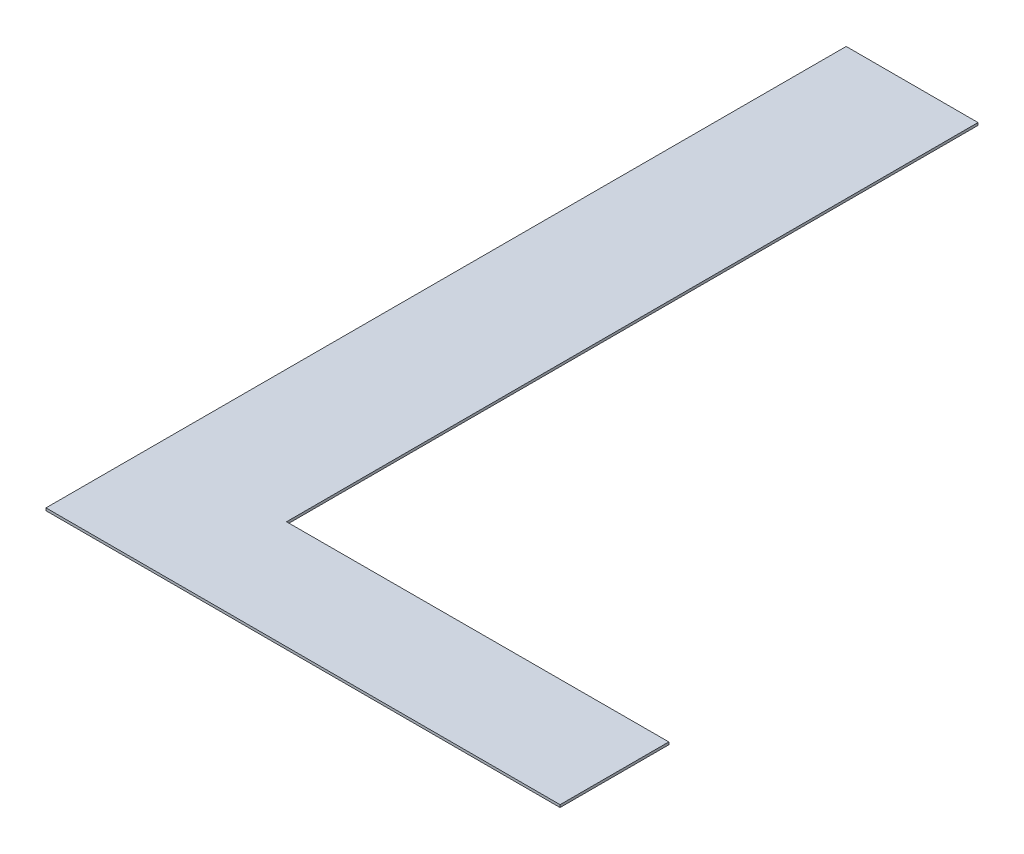
ISO-10303-21;
HEADER;
FILE_DESCRIPTION(('STEP AP214'),'2;1');
FILE_NAME('part.step','',(''),(''),'','','');
FILE_SCHEMA(('AUTOMOTIVE_DESIGN { 1 0 10303 214 1 1 1 1 }'));
ENDSEC;
DATA;
#1=APPLICATION_CONTEXT('core data for automotive mechanical design processes');
#2=APPLICATION_PROTOCOL_DEFINITION('international standard','automotive_design',2000,#1);
#3=PRODUCT_CONTEXT('',#1,'mechanical');
#4=PRODUCT('Part','Part','',(#3));
#5=PRODUCT_RELATED_PRODUCT_CATEGORY('part','',(#4));
#6=PRODUCT_DEFINITION_FORMATION('','',#4);
#7=PRODUCT_DEFINITION_CONTEXT('part definition',#1,'design');
#8=PRODUCT_DEFINITION('design','',#6,#7);
#9=PRODUCT_DEFINITION_SHAPE('','',#8);
#10=(LENGTH_UNIT() NAMED_UNIT(*) SI_UNIT(.MILLI.,.METRE.));
#11=(NAMED_UNIT(*) PLANE_ANGLE_UNIT() SI_UNIT($,.RADIAN.));
#12=(NAMED_UNIT(*) SI_UNIT($,.STERADIAN.) SOLID_ANGLE_UNIT());
#13=UNCERTAINTY_MEASURE_WITH_UNIT(LENGTH_MEASURE(1.E-05),#10,'distance_accuracy_value','');
#14=(GEOMETRIC_REPRESENTATION_CONTEXT(3) GLOBAL_UNCERTAINTY_ASSIGNED_CONTEXT((#13)) GLOBAL_UNIT_ASSIGNED_CONTEXT((#10,
#11,#12)) REPRESENTATION_CONTEXT('',''));
#15=CARTESIAN_POINT('',(0.,0.,0.));
#16=DIRECTION('',(0.,0.,1.));
#17=DIRECTION('',(1.,0.,0.));
#18=AXIS2_PLACEMENT_3D('',#15,#16,#17);
#19=CARTESIAN_POINT('',(0.,6.,0.));
#20=DIRECTION('',(0.,-1.,0.));
#21=DIRECTION('',(0.,0.,-1.));
#22=AXIS2_PLACEMENT_3D('',#19,#20,#21);
#23=PLANE('',#22);
#24=DIRECTION('',(-0.999999182371605,0.,0.00127877133295549));
#25=VECTOR('',#24,1.);
#26=CARTESIAN_POINT('',(-14.80186666602,6.,3.602438528585));
#27=LINE('',#26,#25);
#28=CARTESIAN_POINT('',(-14.80186666602,6.,3.602438528585));
#29=VERTEX_POINT('',#28);
#30=CARTESIAN_POINT('',(-16.3176481068,6.,3.604376868023));
#31=VERTEX_POINT('',#30);
#32=EDGE_CURVE('E20',#29,#31,#27,.T.);
#33=ORIENTED_EDGE('',*,*,#32,.F.);
#34=DIRECTION('',(0.,0.,-1.));
#35=VECTOR('',#34,1.);
#36=CARTESIAN_POINT('',(-14.80186666602,6.,4.034042110188));
#37=LINE('',#36,#35);
#38=CARTESIAN_POINT('',(-14.80186666602,6.,4.034042110188));
#39=VERTEX_POINT('',#38);
#40=EDGE_CURVE('E27',#39,#29,#37,.T.);
#41=ORIENTED_EDGE('',*,*,#40,.F.);
#42=DIRECTION('',(1.,0.,0.));
#43=VECTOR('',#42,1.);
#44=CARTESIAN_POINT('',(-16.84293809459,6.,4.034042110188));
#45=LINE('',#44,#43);
#46=CARTESIAN_POINT('',(-16.84293809459,6.,4.034042110188));
#47=VERTEX_POINT('',#46);
#48=EDGE_CURVE('E120',#47,#39,#45,.T.);
#49=ORIENTED_EDGE('',*,*,#48,.F.);
#50=DIRECTION('',(-0.000610500496729928,0.,0.999999813644554));
#51=VECTOR('',#50,1.);
#52=CARTESIAN_POINT('',(-16.84099975516,6.,0.859042110188));
#53=LINE('',#52,#51);
#54=CARTESIAN_POINT('',(-16.84099975516,6.,0.859042110188));
#55=VERTEX_POINT('',#54);
#56=EDGE_CURVE('E128',#55,#47,#53,.T.);
#57=ORIENTED_EDGE('',*,*,#56,.F.);
#58=DIRECTION('',(-1.,0.,0.));
#59=VECTOR('',#58,1.);
#60=CARTESIAN_POINT('',(-16.3176481068,6.,0.859042110188));
#61=LINE('',#60,#59);
#62=CARTESIAN_POINT('',(-16.3176481068,6.,0.859042110188));
#63=VERTEX_POINT('',#62);
#64=EDGE_CURVE('E100',#63,#55,#61,.T.);
#65=ORIENTED_EDGE('',*,*,#64,.F.);
#66=DIRECTION('',(0.,0.,-1.));
#67=VECTOR('',#66,1.);
#68=CARTESIAN_POINT('',(-16.3176481068,6.,3.604376868023));
#69=LINE('',#68,#67);
#70=EDGE_CURVE('E81',#31,#63,#69,.T.);
#71=ORIENTED_EDGE('',*,*,#70,.F.);
#72=EDGE_LOOP('',(#33,#41,#49,#57,#65,#71));
#73=FACE_BOUND('',#72,.T.);
#74=ADVANCED_FACE('F16',(#73),#23,.T.);
#75=CARTESIAN_POINT('',(0.,6.01,0.));
#76=DIRECTION('',(0.,-1.,0.));
#77=DIRECTION('',(0.,0.,-1.));
#78=AXIS2_PLACEMENT_3D('',#75,#76,#77);
#79=PLANE('',#78);
#80=DIRECTION('',(-0.999999182371605,0.,0.00127877133295549));
#81=VECTOR('',#80,1.);
#82=CARTESIAN_POINT('',(-14.80186666602,6.01,3.602438528585));
#83=LINE('',#82,#81);
#84=CARTESIAN_POINT('',(-14.80186666602,6.01,3.602438528585));
#85=VERTEX_POINT('',#84);
#86=CARTESIAN_POINT('',(-16.3176481068,6.01,3.604376868023));
#87=VERTEX_POINT('',#86);
#88=EDGE_CURVE('E103',#85,#87,#83,.T.);
#89=ORIENTED_EDGE('',*,*,#88,.T.);
#90=DIRECTION('',(0.,0.,-1.));
#91=VECTOR('',#90,1.);
#92=CARTESIAN_POINT('',(-16.3176481068,6.01,3.604376868023));
#93=LINE('',#92,#91);
#94=CARTESIAN_POINT('',(-16.3176481068,6.01,0.859042110188));
#95=VERTEX_POINT('',#94);
#96=EDGE_CURVE('E89',#87,#95,#93,.T.);
#97=ORIENTED_EDGE('',*,*,#96,.T.);
#98=DIRECTION('',(-1.,0.,0.));
#99=VECTOR('',#98,1.);
#100=CARTESIAN_POINT('',(-16.3176481068,6.01,0.859042110188));
#101=LINE('',#100,#99);
#102=CARTESIAN_POINT('',(-16.84099975516,6.01,0.859042110188));
#103=VERTEX_POINT('',#102);
#104=EDGE_CURVE('E126',#95,#103,#101,.T.);
#105=ORIENTED_EDGE('',*,*,#104,.T.);
#106=DIRECTION('',(-0.000610500496729928,0.,0.999999813644554));
#107=VECTOR('',#106,1.);
#108=CARTESIAN_POINT('',(-16.84099975516,6.01,0.859042110188));
#109=LINE('',#108,#107);
#110=CARTESIAN_POINT('',(-16.84293809459,6.01,4.034042110188));
#111=VERTEX_POINT('',#110);
#112=EDGE_CURVE('E117',#103,#111,#109,.T.);
#113=ORIENTED_EDGE('',*,*,#112,.T.);
#114=DIRECTION('',(1.,0.,0.));
#115=VECTOR('',#114,1.);
#116=CARTESIAN_POINT('',(-16.84293809459,6.01,4.034042110188));
#117=LINE('',#116,#115);
#118=CARTESIAN_POINT('',(-14.80186666602,6.01,4.034042110188));
#119=VERTEX_POINT('',#118);
#120=EDGE_CURVE('E125',#111,#119,#117,.T.);
#121=ORIENTED_EDGE('',*,*,#120,.T.);
#122=DIRECTION('',(0.,0.,-1.));
#123=VECTOR('',#122,1.);
#124=CARTESIAN_POINT('',(-14.80186666602,6.01,4.034042110188));
#125=LINE('',#124,#123);
#126=EDGE_CURVE('E11',#119,#85,#125,.T.);
#127=ORIENTED_EDGE('',*,*,#126,.T.);
#128=EDGE_LOOP('',(#89,#97,#105,#113,#121,#127));
#129=FACE_BOUND('',#128,.T.);
#130=ADVANCED_FACE('F104',(#129),#79,.F.);
#131=CARTESIAN_POINT('',(-14.80186666602,6.01,4.034042110188));
#132=DIRECTION('',(-1.,0.,0.));
#133=DIRECTION('',(0.,0.,1.));
#134=AXIS2_PLACEMENT_3D('',#131,#132,#133);
#135=PLANE('',#134);
#136=ORIENTED_EDGE('',*,*,#40,.T.);
#137=DIRECTION('',(0.,-1.,0.));
#138=VECTOR('',#137,1.);
#139=CARTESIAN_POINT('',(-14.80186666602,6.01,3.602438528585));
#140=LINE('',#139,#138);
#141=EDGE_CURVE('E108',#85,#29,#140,.T.);
#142=ORIENTED_EDGE('',*,*,#141,.F.);
#143=ORIENTED_EDGE('',*,*,#126,.F.);
#144=DIRECTION('',(0.,-1.,0.));
#145=VECTOR('',#144,1.);
#146=CARTESIAN_POINT('',(-14.80186666602,6.01,4.034042110188));
#147=LINE('',#146,#145);
#148=EDGE_CURVE('E122',#119,#39,#147,.T.);
#149=ORIENTED_EDGE('',*,*,#148,.T.);
#150=EDGE_LOOP('',(#136,#142,#143,#149));
#151=FACE_BOUND('',#150,.T.);
#152=ADVANCED_FACE('F167',(#151),#135,.F.);
#153=CARTESIAN_POINT('',(-16.84293809459,6.01,4.034042110188));
#154=DIRECTION('',(0.,0.,-1.));
#155=DIRECTION('',(0.,-1.,0.));
#156=AXIS2_PLACEMENT_3D('',#153,#154,#155);
#157=PLANE('',#156);
#158=ORIENTED_EDGE('',*,*,#48,.T.);
#159=ORIENTED_EDGE('',*,*,#148,.F.);
#160=ORIENTED_EDGE('',*,*,#120,.F.);
#161=DIRECTION('',(0.,-1.,0.));
#162=VECTOR('',#161,1.);
#163=CARTESIAN_POINT('',(-16.84293809459,6.01,4.034042110188));
#164=LINE('',#163,#162);
#165=EDGE_CURVE('E121',#111,#47,#164,.T.);
#166=ORIENTED_EDGE('',*,*,#165,.T.);
#167=EDGE_LOOP('',(#158,#159,#160,#166));
#168=FACE_BOUND('',#167,.T.);
#169=ADVANCED_FACE('F163',(#168),#157,.F.);
#170=CARTESIAN_POINT('',(-16.84099975516,6.01,0.859042110188));
#171=DIRECTION('',(0.999999813644554,0.,0.000610500496729928));
#172=DIRECTION('',(0.,-1.,0.));
#173=AXIS2_PLACEMENT_3D('',#170,#171,#172);
#174=PLANE('',#173);
#175=ORIENTED_EDGE('',*,*,#56,.T.);
#176=ORIENTED_EDGE('',*,*,#165,.F.);
#177=ORIENTED_EDGE('',*,*,#112,.F.);
#178=DIRECTION('',(0.,-1.,0.));
#179=VECTOR('',#178,1.);
#180=CARTESIAN_POINT('',(-16.84099975516,6.01,0.859042110188));
#181=LINE('',#180,#179);
#182=EDGE_CURVE('E129',#103,#55,#181,.T.);
#183=ORIENTED_EDGE('',*,*,#182,.T.);
#184=EDGE_LOOP('',(#175,#176,#177,#183));
#185=FACE_BOUND('',#184,.T.);
#186=ADVANCED_FACE('F166',(#185),#174,.F.);
#187=CARTESIAN_POINT('',(-16.3176481068,6.01,0.859042110188));
#188=DIRECTION('',(0.,0.,1.));
#189=DIRECTION('',(1.,0.,0.));
#190=AXIS2_PLACEMENT_3D('',#187,#188,#189);
#191=PLANE('',#190);
#192=ORIENTED_EDGE('',*,*,#64,.T.);
#193=ORIENTED_EDGE('',*,*,#182,.F.);
#194=ORIENTED_EDGE('',*,*,#104,.F.);
#195=DIRECTION('',(0.,-1.,0.));
#196=VECTOR('',#195,1.);
#197=CARTESIAN_POINT('',(-16.3176481068,6.01,0.859042110188));
#198=LINE('',#197,#196);
#199=EDGE_CURVE('E96',#95,#63,#198,.T.);
#200=ORIENTED_EDGE('',*,*,#199,.T.);
#201=EDGE_LOOP('',(#192,#193,#194,#200));
#202=FACE_BOUND('',#201,.T.);
#203=ADVANCED_FACE('F145',(#202),#191,.F.);
#204=CARTESIAN_POINT('',(-16.3176481068,6.01,3.604376868023));
#205=DIRECTION('',(-1.,0.,0.));
#206=DIRECTION('',(0.,0.,1.));
#207=AXIS2_PLACEMENT_3D('',#204,#205,#206);
#208=PLANE('',#207);
#209=ORIENTED_EDGE('',*,*,#70,.T.);
#210=ORIENTED_EDGE('',*,*,#199,.F.);
#211=ORIENTED_EDGE('',*,*,#96,.F.);
#212=DIRECTION('',(0.,-1.,0.));
#213=VECTOR('',#212,1.);
#214=CARTESIAN_POINT('',(-16.3176481068,6.01,3.604376868023));
#215=LINE('',#214,#213);
#216=EDGE_CURVE('E93',#87,#31,#215,.T.);
#217=ORIENTED_EDGE('',*,*,#216,.T.);
#218=EDGE_LOOP('',(#209,#210,#211,#217));
#219=FACE_BOUND('',#218,.T.);
#220=ADVANCED_FACE('F91',(#219),#208,.F.);
#221=CARTESIAN_POINT('',(-14.80186666602,6.01,3.602438528585));
#222=DIRECTION('',(0.00127877133295549,0.,0.999999182371605));
#223=DIRECTION('',(0.,-1.,0.));
#224=AXIS2_PLACEMENT_3D('',#221,#222,#223);
#225=PLANE('',#224);
#226=ORIENTED_EDGE('',*,*,#32,.T.);
#227=ORIENTED_EDGE('',*,*,#216,.F.);
#228=ORIENTED_EDGE('',*,*,#88,.F.);
#229=ORIENTED_EDGE('',*,*,#141,.T.);
#230=EDGE_LOOP('',(#226,#227,#228,#229));
#231=FACE_BOUND('',#230,.T.);
#232=ADVANCED_FACE('F18',(#231),#225,.F.);
#233=CLOSED_SHELL('',(#74,#130,#152,#169,#186,#203,#220,#232));
#234=MANIFOLD_SOLID_BREP('B1',#233);
#235=ADVANCED_BREP_SHAPE_REPRESENTATION('',(#18,#234),#14);
#236=SHAPE_DEFINITION_REPRESENTATION(#9,#235);
ENDSEC;
END-ISO-10303-21;
